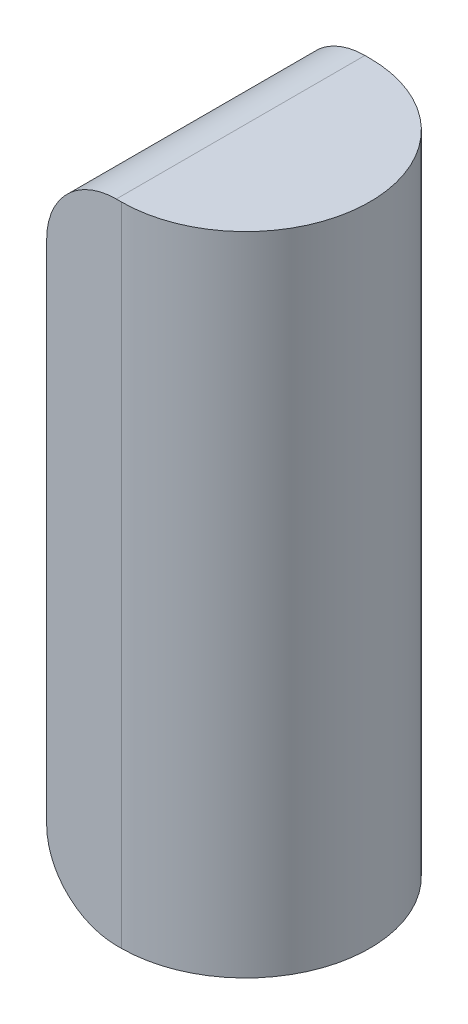
ISO-10303-21;
HEADER;
FILE_DESCRIPTION(('STEP AP214'),'2;1');
FILE_NAME('part.step','',(''),(''),'','','');
FILE_SCHEMA(('AUTOMOTIVE_DESIGN { 1 0 10303 214 1 1 1 1 }'));
ENDSEC;
DATA;
#1=APPLICATION_CONTEXT('core data for automotive mechanical design processes');
#2=APPLICATION_PROTOCOL_DEFINITION('international standard','automotive_design',2000,#1);
#3=PRODUCT_CONTEXT('',#1,'mechanical');
#4=PRODUCT('Part','Part','',(#3));
#5=PRODUCT_RELATED_PRODUCT_CATEGORY('part','',(#4));
#6=PRODUCT_DEFINITION_FORMATION('','',#4);
#7=PRODUCT_DEFINITION_CONTEXT('part definition',#1,'design');
#8=PRODUCT_DEFINITION('design','',#6,#7);
#9=PRODUCT_DEFINITION_SHAPE('','',#8);
#10=(LENGTH_UNIT() NAMED_UNIT(*) SI_UNIT(.MILLI.,.METRE.));
#11=(NAMED_UNIT(*) PLANE_ANGLE_UNIT() SI_UNIT($,.RADIAN.));
#12=(NAMED_UNIT(*) SI_UNIT($,.STERADIAN.) SOLID_ANGLE_UNIT());
#13=UNCERTAINTY_MEASURE_WITH_UNIT(LENGTH_MEASURE(1.E-05),#10,'distance_accuracy_value','');
#14=(GEOMETRIC_REPRESENTATION_CONTEXT(3) GLOBAL_UNCERTAINTY_ASSIGNED_CONTEXT((#13)) GLOBAL_UNIT_ASSIGNED_CONTEXT((#10,
#11,#12)) REPRESENTATION_CONTEXT('',''));
#15=CARTESIAN_POINT('',(0.,0.,0.));
#16=DIRECTION('',(0.,0.,1.));
#17=DIRECTION('',(1.,0.,0.));
#18=AXIS2_PLACEMENT_3D('',#15,#16,#17);
#19=CARTESIAN_POINT('',(-0.725,0.,0.));
#20=DIRECTION('',(0.,1.,0.));
#21=DIRECTION('',(0.,0.,1.));
#22=AXIS2_PLACEMENT_3D('',#19,#20,#21);
#23=CYLINDRICAL_SURFACE('',#22,0.125);
#24=CARTESIAN_POINT('',(-0.725,0.65,0.));
#25=DIRECTION('',(0.,1.,0.));
#26=DIRECTION('',(0.,0.,1.));
#27=AXIS2_PLACEMENT_3D('',#24,#25,#26);
#28=CIRCLE('',#27,0.125);
#29=CARTESIAN_POINT('',(-0.725,0.65,0.125));
#30=VERTEX_POINT('',#29);
#31=CARTESIAN_POINT('',(-0.725,0.65,-0.125));
#32=VERTEX_POINT('',#31);
#33=EDGE_CURVE('E11',#30,#32,#28,.T.);
#34=ORIENTED_EDGE('',*,*,#33,.F.);
#35=DIRECTION('',(0.,1.,0.));
#36=VECTOR('',#35,1.);
#37=CARTESIAN_POINT('',(-0.725,0.,0.125));
#38=LINE('',#37,#36);
#39=CARTESIAN_POINT('',(-0.725,0.,0.125));
#40=VERTEX_POINT('',#39);
#41=EDGE_CURVE('E24',#40,#30,#38,.T.);
#42=ORIENTED_EDGE('',*,*,#41,.F.);
#43=CARTESIAN_POINT('',(-0.725,0.,0.));
#44=DIRECTION('',(0.,1.,0.));
#45=DIRECTION('',(0.,0.,1.));
#46=AXIS2_PLACEMENT_3D('',#43,#44,#45);
#47=CIRCLE('',#46,0.125);
#48=CARTESIAN_POINT('',(-0.725,0.,-0.125));
#49=VERTEX_POINT('',#48);
#50=EDGE_CURVE('E83',#40,#49,#47,.T.);
#51=ORIENTED_EDGE('',*,*,#50,.T.);
#52=DIRECTION('',(0.,1.,0.));
#53=VECTOR('',#52,1.);
#54=CARTESIAN_POINT('',(-0.725,0.,-0.125));
#55=LINE('',#54,#53);
#56=EDGE_CURVE('E113',#49,#32,#55,.T.);
#57=ORIENTED_EDGE('',*,*,#56,.T.);
#58=EDGE_LOOP('',(#34,#42,#51,#57));
#59=FACE_BOUND('',#58,.T.);
#60=ADVANCED_FACE('F17',(#59),#23,.T.);
#61=CARTESIAN_POINT('',(-0.8,0.,-0.125));
#62=DIRECTION('',(0.,0.,-1.));
#63=DIRECTION('',(-1.,0.,0.));
#64=AXIS2_PLACEMENT_3D('',#61,#62,#63);
#65=PLANE('',#64);
#66=CARTESIAN_POINT('',(-0.73,0.58,-0.125));
#67=DIRECTION('',(0.,0.,1.));
#68=DIRECTION('',(-1.,0.,0.));
#69=AXIS2_PLACEMENT_3D('',#66,#67,#68);
#70=CIRCLE('',#69,0.07);
#71=CARTESIAN_POINT('',(-0.73,0.65,-0.125));
#72=VERTEX_POINT('',#71);
#73=CARTESIAN_POINT('',(-0.8,0.58,-0.125));
#74=VERTEX_POINT('',#73);
#75=EDGE_CURVE('E111',#72,#74,#70,.T.);
#76=ORIENTED_EDGE('',*,*,#75,.F.);
#77=DIRECTION('',(-1.,0.,0.));
#78=VECTOR('',#77,1.);
#79=CARTESIAN_POINT('',(0.,0.65,-0.125));
#80=LINE('',#79,#78);
#81=EDGE_CURVE('E109',#32,#72,#80,.T.);
#82=ORIENTED_EDGE('',*,*,#81,.F.);
#83=ORIENTED_EDGE('',*,*,#56,.F.);
#84=DIRECTION('',(-1.,0.,0.));
#85=VECTOR('',#84,1.);
#86=CARTESIAN_POINT('',(0.,0.,-0.125));
#87=LINE('',#86,#85);
#88=CARTESIAN_POINT('',(-0.73,0.,-0.125));
#89=VERTEX_POINT('',#88);
#90=EDGE_CURVE('E107',#49,#89,#87,.T.);
#91=ORIENTED_EDGE('',*,*,#90,.T.);
#92=CARTESIAN_POINT('',(-0.73,0.07,-0.125));
#93=DIRECTION('',(0.,0.,1.));
#94=DIRECTION('',(-1.,0.,0.));
#95=AXIS2_PLACEMENT_3D('',#92,#93,#94);
#96=CIRCLE('',#95,0.07);
#97=CARTESIAN_POINT('',(-0.8,0.07,-0.125));
#98=VERTEX_POINT('',#97);
#99=EDGE_CURVE('E88',#98,#89,#96,.T.);
#100=ORIENTED_EDGE('',*,*,#99,.F.);
#101=DIRECTION('',(0.,1.,0.));
#102=VECTOR('',#101,1.);
#103=CARTESIAN_POINT('',(-0.8,0.65,-0.125));
#104=LINE('',#103,#102);
#105=EDGE_CURVE('E103',#98,#74,#104,.T.);
#106=ORIENTED_EDGE('',*,*,#105,.T.);
#107=EDGE_LOOP('',(#76,#82,#83,#91,#100,#106));
#108=FACE_BOUND('',#107,.T.);
#109=ADVANCED_FACE('F126',(#108),#65,.T.);
#110=CARTESIAN_POINT('',(-0.725,0.,0.125));
#111=DIRECTION('',(0.,0.,1.));
#112=DIRECTION('',(1.,0.,0.));
#113=AXIS2_PLACEMENT_3D('',#110,#111,#112);
#114=PLANE('',#113);
#115=CARTESIAN_POINT('',(-0.73,0.58,0.125));
#116=DIRECTION('',(0.,0.,-1.));
#117=DIRECTION('',(1.,0.,0.));
#118=AXIS2_PLACEMENT_3D('',#115,#116,#117);
#119=CIRCLE('',#118,0.07);
#120=CARTESIAN_POINT('',(-0.8,0.58,0.125));
#121=VERTEX_POINT('',#120);
#122=CARTESIAN_POINT('',(-0.73,0.65,0.125));
#123=VERTEX_POINT('',#122);
#124=EDGE_CURVE('E101',#121,#123,#119,.T.);
#125=ORIENTED_EDGE('',*,*,#124,.F.);
#126=DIRECTION('',(0.,-1.,0.));
#127=VECTOR('',#126,1.);
#128=CARTESIAN_POINT('',(-0.8,0.65,0.125));
#129=LINE('',#128,#127);
#130=CARTESIAN_POINT('',(-0.8,0.07,0.125));
#131=VERTEX_POINT('',#130);
#132=EDGE_CURVE('E71',#121,#131,#129,.T.);
#133=ORIENTED_EDGE('',*,*,#132,.T.);
#134=CARTESIAN_POINT('',(-0.73,0.07,0.125));
#135=DIRECTION('',(0.,0.,-1.));
#136=DIRECTION('',(1.,0.,0.));
#137=AXIS2_PLACEMENT_3D('',#134,#135,#136);
#138=CIRCLE('',#137,0.07);
#139=CARTESIAN_POINT('',(-0.73,0.,0.125));
#140=VERTEX_POINT('',#139);
#141=EDGE_CURVE('E66',#140,#131,#138,.T.);
#142=ORIENTED_EDGE('',*,*,#141,.F.);
#143=DIRECTION('',(1.,0.,0.));
#144=VECTOR('',#143,1.);
#145=CARTESIAN_POINT('',(0.,0.,0.125));
#146=LINE('',#145,#144);
#147=EDGE_CURVE('E69',#140,#40,#146,.T.);
#148=ORIENTED_EDGE('',*,*,#147,.T.);
#149=ORIENTED_EDGE('',*,*,#41,.T.);
#150=DIRECTION('',(1.,0.,0.));
#151=VECTOR('',#150,1.);
#152=CARTESIAN_POINT('',(0.,0.65,0.125));
#153=LINE('',#152,#151);
#154=EDGE_CURVE('E84',#123,#30,#153,.T.);
#155=ORIENTED_EDGE('',*,*,#154,.F.);
#156=EDGE_LOOP('',(#125,#133,#142,#148,#149,#155));
#157=FACE_BOUND('',#156,.T.);
#158=ADVANCED_FACE('F68',(#157),#114,.T.);
#159=CARTESIAN_POINT('',(-0.73,0.58,0.));
#160=DIRECTION('',(0.,0.,-1.));
#161=DIRECTION('',(-1.,0.,0.));
#162=AXIS2_PLACEMENT_3D('',#159,#160,#161);
#163=CYLINDRICAL_SURFACE('',#162,0.07);
#164=DIRECTION('',(0.,0.,-1.));
#165=VECTOR('',#164,1.);
#166=CARTESIAN_POINT('',(-0.8,0.58,-0.4));
#167=LINE('',#166,#165);
#168=EDGE_CURVE('E96',#121,#74,#167,.T.);
#169=ORIENTED_EDGE('',*,*,#168,.F.);
#170=ORIENTED_EDGE('',*,*,#124,.T.);
#171=DIRECTION('',(0.,0.,1.));
#172=VECTOR('',#171,1.);
#173=CARTESIAN_POINT('',(-0.73,0.65,0.4));
#174=LINE('',#173,#172);
#175=EDGE_CURVE('E91',#72,#123,#174,.T.);
#176=ORIENTED_EDGE('',*,*,#175,.F.);
#177=ORIENTED_EDGE('',*,*,#75,.T.);
#178=EDGE_LOOP('',(#169,#170,#176,#177));
#179=FACE_BOUND('',#178,.T.);
#180=ADVANCED_FACE('F121',(#179),#163,.T.);
#181=CARTESIAN_POINT('',(0.,0.65,0.));
#182=DIRECTION('',(0.,1.,0.));
#183=DIRECTION('',(0.,0.,1.));
#184=AXIS2_PLACEMENT_3D('',#181,#182,#183);
#185=PLANE('',#184);
#186=ORIENTED_EDGE('',*,*,#175,.T.);
#187=ORIENTED_EDGE('',*,*,#154,.T.);
#188=ORIENTED_EDGE('',*,*,#33,.T.);
#189=ORIENTED_EDGE('',*,*,#81,.T.);
#190=EDGE_LOOP('',(#186,#187,#188,#189));
#191=FACE_BOUND('',#190,.T.);
#192=ADVANCED_FACE('F116',(#191),#185,.T.);
#193=CARTESIAN_POINT('',(-0.8,0.65,0.4));
#194=DIRECTION('',(1.,0.,0.));
#195=DIRECTION('',(0.,0.,-1.));
#196=AXIS2_PLACEMENT_3D('',#193,#194,#195);
#197=PLANE('',#196);
#198=ORIENTED_EDGE('',*,*,#132,.F.);
#199=ORIENTED_EDGE('',*,*,#168,.T.);
#200=ORIENTED_EDGE('',*,*,#105,.F.);
#201=DIRECTION('',(0.,0.,1.));
#202=VECTOR('',#201,1.);
#203=CARTESIAN_POINT('',(-0.8,0.07,0.4));
#204=LINE('',#203,#202);
#205=EDGE_CURVE('E89',#98,#131,#204,.T.);
#206=ORIENTED_EDGE('',*,*,#205,.T.);
#207=EDGE_LOOP('',(#198,#199,#200,#206));
#208=FACE_BOUND('',#207,.T.);
#209=ADVANCED_FACE('F123',(#208),#197,.F.);
#210=CARTESIAN_POINT('',(-0.73,0.07,0.4));
#211=DIRECTION('',(0.,0.,1.));
#212=DIRECTION('',(1.,0.,0.));
#213=AXIS2_PLACEMENT_3D('',#210,#211,#212);
#214=CYLINDRICAL_SURFACE('',#213,0.07);
#215=DIRECTION('',(0.,0.,-1.));
#216=VECTOR('',#215,1.);
#217=CARTESIAN_POINT('',(-0.73,0.,0.));
#218=LINE('',#217,#216);
#219=EDGE_CURVE('E82',#140,#89,#218,.T.);
#220=ORIENTED_EDGE('',*,*,#219,.F.);
#221=ORIENTED_EDGE('',*,*,#141,.T.);
#222=ORIENTED_EDGE('',*,*,#205,.F.);
#223=ORIENTED_EDGE('',*,*,#99,.T.);
#224=EDGE_LOOP('',(#220,#221,#222,#223));
#225=FACE_BOUND('',#224,.T.);
#226=ADVANCED_FACE('F87',(#225),#214,.T.);
#227=CARTESIAN_POINT('',(0.,0.,0.));
#228=DIRECTION('',(0.,1.,0.));
#229=DIRECTION('',(0.,0.,1.));
#230=AXIS2_PLACEMENT_3D('',#227,#228,#229);
#231=PLANE('',#230);
#232=ORIENTED_EDGE('',*,*,#147,.F.);
#233=ORIENTED_EDGE('',*,*,#219,.T.);
#234=ORIENTED_EDGE('',*,*,#90,.F.);
#235=ORIENTED_EDGE('',*,*,#50,.F.);
#236=EDGE_LOOP('',(#232,#233,#234,#235));
#237=FACE_BOUND('',#236,.T.);
#238=ADVANCED_FACE('F80',(#237),#231,.F.);
#239=CLOSED_SHELL('',(#60,#109,#158,#180,#192,#209,#226,#238));
#240=MANIFOLD_SOLID_BREP('B1',#239);
#241=ADVANCED_BREP_SHAPE_REPRESENTATION('',(#18,#240),#14);
#242=SHAPE_DEFINITION_REPRESENTATION(#9,#241);
ENDSEC;
END-ISO-10303-21;
